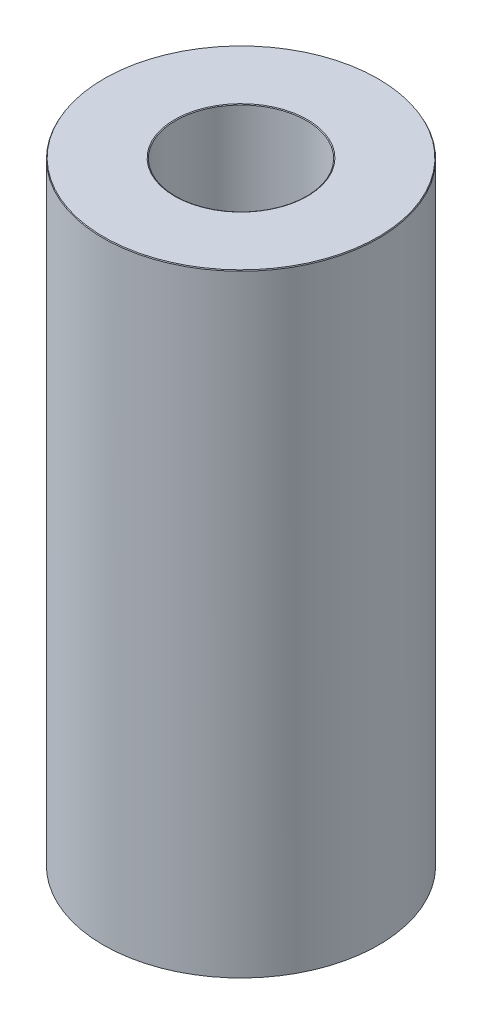
ISO-10303-21;
HEADER;
FILE_DESCRIPTION(('STEP AP214'),'2;1');
FILE_NAME('part.step','',(''),(''),'','','');
FILE_SCHEMA(('AUTOMOTIVE_DESIGN { 1 0 10303 214 1 1 1 1 }'));
ENDSEC;
DATA;
#1=APPLICATION_CONTEXT('core data for automotive mechanical design processes');
#2=APPLICATION_PROTOCOL_DEFINITION('international standard','automotive_design',2000,#1);
#3=PRODUCT_CONTEXT('',#1,'mechanical');
#4=PRODUCT('Part','Part','',(#3));
#5=PRODUCT_RELATED_PRODUCT_CATEGORY('part','',(#4));
#6=PRODUCT_DEFINITION_FORMATION('','',#4);
#7=PRODUCT_DEFINITION_CONTEXT('part definition',#1,'design');
#8=PRODUCT_DEFINITION('design','',#6,#7);
#9=PRODUCT_DEFINITION_SHAPE('','',#8);
#10=(LENGTH_UNIT() NAMED_UNIT(*) SI_UNIT(.MILLI.,.METRE.));
#11=(NAMED_UNIT(*) PLANE_ANGLE_UNIT() SI_UNIT($,.RADIAN.));
#12=(NAMED_UNIT(*) SI_UNIT($,.STERADIAN.) SOLID_ANGLE_UNIT());
#13=UNCERTAINTY_MEASURE_WITH_UNIT(LENGTH_MEASURE(1.E-05),#10,'distance_accuracy_value','');
#14=(GEOMETRIC_REPRESENTATION_CONTEXT(3) GLOBAL_UNCERTAINTY_ASSIGNED_CONTEXT((#13)) GLOBAL_UNIT_ASSIGNED_CONTEXT((#10,
#11,#12)) REPRESENTATION_CONTEXT('',''));
#15=CARTESIAN_POINT('',(0.,0.,0.));
#16=DIRECTION('',(0.,0.,1.));
#17=DIRECTION('',(1.,0.,0.));
#18=AXIS2_PLACEMENT_3D('',#15,#16,#17);
#19=CARTESIAN_POINT('',(0.,167.16921961513,0.));
#20=DIRECTION('',(0.,-1.,0.));
#21=DIRECTION('',(0.,0.,-1.));
#22=AXIS2_PLACEMENT_3D('',#19,#20,#21);
#23=CYLINDRICAL_SURFACE('',#22,37.5);
#24=CARTESIAN_POINT('',(0.,0.136813368548816,0.));
#25=DIRECTION('',(0.,1.,0.));
#26=DIRECTION('',(0.,0.,1.));
#27=AXIS2_PLACEMENT_3D('',#24,#25,#26);
#28=CIRCLE('',#27,37.5);
#29=CARTESIAN_POINT('',(0.,0.136813368548816,37.5));
#30=VERTEX_POINT('',#29);
#31=EDGE_CURVE('E10',#30,#30,#28,.T.);
#32=ORIENTED_EDGE('',*,*,#31,.T.);
#33=EDGE_LOOP('',(#32));
#34=FACE_BOUND('',#33,.T.);
#35=CARTESIAN_POINT('',(0.,166.932251909649,0.));
#36=DIRECTION('',(0.,1.,0.));
#37=DIRECTION('',(0.,0.,1.));
#38=AXIS2_PLACEMENT_3D('',#35,#36,#37);
#39=CIRCLE('',#38,37.5);
#40=CARTESIAN_POINT('',(0.,166.932251909649,-37.5));
#41=VERTEX_POINT('',#40);
#42=EDGE_CURVE('E50',#41,#41,#39,.F.);
#43=ORIENTED_EDGE('',*,*,#42,.T.);
#44=EDGE_LOOP('',(#43));
#45=FACE_BOUND('',#44,.T.);
#46=ADVANCED_FACE('F39',(#34,#45),#23,.T.);
#47=CARTESIAN_POINT('',(0.,167.16921961513,0.));
#48=DIRECTION('',(0.,1.,0.));
#49=DIRECTION('',(0.,0.,1.));
#50=AXIS2_PLACEMENT_3D('',#47,#48,#49);
#51=PLANE('',#50);
#52=CARTESIAN_POINT('',(0.,167.16921961513,0.));
#53=DIRECTION('',(0.,1.,0.));
#54=DIRECTION('',(0.,0.,1.));
#55=AXIS2_PLACEMENT_3D('',#52,#53,#54);
#56=CIRCLE('',#55,18.0977422977197);
#57=CARTESIAN_POINT('',(0.,167.16921961513,18.0977422977197));
#58=VERTEX_POINT('',#57);
#59=EDGE_CURVE('E58',#58,#58,#56,.F.);
#60=ORIENTED_EDGE('',*,*,#59,.T.);
#61=EDGE_LOOP('',(#60));
#62=FACE_BOUND('',#61,.T.);
#63=CARTESIAN_POINT('',(0.,167.16921961513,0.));
#64=DIRECTION('',(0.,1.,0.));
#65=DIRECTION('',(0.,0.,1.));
#66=AXIS2_PLACEMENT_3D('',#63,#64,#65);
#67=CIRCLE('',#66,37.3631866314512);
#68=CARTESIAN_POINT('',(0.,167.16921961513,-37.3631866314512));
#69=VERTEX_POINT('',#68);
#70=EDGE_CURVE('E61',#69,#69,#67,.T.);
#71=ORIENTED_EDGE('',*,*,#70,.T.);
#72=EDGE_LOOP('',(#71));
#73=FACE_BOUND('',#72,.T.);
#74=ADVANCED_FACE('F88',(#62,#73),#51,.T.);
#75=CARTESIAN_POINT('',(0.,0.,0.));
#76=DIRECTION('',(0.,1.,0.));
#77=DIRECTION('',(0.,0.,1.));
#78=AXIS2_PLACEMENT_3D('',#75,#76,#77);
#79=PLANE('',#78);
#80=CARTESIAN_POINT('',(0.,0.,0.));
#81=DIRECTION('',(0.,1.,0.));
#82=DIRECTION('',(0.,0.,1.));
#83=AXIS2_PLACEMENT_3D('',#80,#81,#82);
#84=CIRCLE('',#83,17.9975879607872);
#85=CARTESIAN_POINT('',(0.,0.,17.9975879607872));
#86=VERTEX_POINT('',#85);
#87=EDGE_CURVE('E51',#86,#86,#84,.T.);
#88=ORIENTED_EDGE('',*,*,#87,.T.);
#89=EDGE_LOOP('',(#88));
#90=FACE_BOUND('',#89,.T.);
#91=CARTESIAN_POINT('',(0.,0.,0.));
#92=DIRECTION('',(0.,1.,0.));
#93=DIRECTION('',(0.,0.,1.));
#94=AXIS2_PLACEMENT_3D('',#91,#92,#93);
#95=CIRCLE('',#94,37.2630322945188);
#96=CARTESIAN_POINT('',(0.,0.,37.2630322945188));
#97=VERTEX_POINT('',#96);
#98=EDGE_CURVE('E54',#97,#97,#95,.F.);
#99=ORIENTED_EDGE('',*,*,#98,.T.);
#100=EDGE_LOOP('',(#99));
#101=FACE_BOUND('',#100,.T.);
#102=ADVANCED_FACE('F83',(#90,#101),#79,.F.);
#103=CARTESIAN_POINT('',(0.,167.16921961513,0.));
#104=DIRECTION('',(0.,-1.,0.));
#105=DIRECTION('',(0.,0.,-1.));
#106=AXIS2_PLACEMENT_3D('',#103,#104,#105);
#107=CYLINDRICAL_SURFACE('',#106,17.8607745922384);
#108=CARTESIAN_POINT('',(0.,167.032406246581,0.));
#109=DIRECTION('',(0.,1.,0.));
#110=DIRECTION('',(0.,0.,1.));
#111=AXIS2_PLACEMENT_3D('',#108,#109,#110);
#112=CIRCLE('',#111,17.8607745922384);
#113=CARTESIAN_POINT('',(0.,167.032406246581,17.8607745922384));
#114=VERTEX_POINT('',#113);
#115=EDGE_CURVE('E67',#114,#114,#112,.T.);
#116=ORIENTED_EDGE('',*,*,#115,.T.);
#117=EDGE_LOOP('',(#116));
#118=FACE_BOUND('',#117,.T.);
#119=CARTESIAN_POINT('',(0.,0.236967705481206,0.));
#120=DIRECTION('',(0.,1.,0.));
#121=DIRECTION('',(0.,0.,1.));
#122=AXIS2_PLACEMENT_3D('',#119,#120,#121);
#123=CIRCLE('',#122,17.8607745922384);
#124=CARTESIAN_POINT('',(0.,0.236967705481206,17.8607745922384));
#125=VERTEX_POINT('',#124);
#126=EDGE_CURVE('E69',#125,#125,#123,.F.);
#127=ORIENTED_EDGE('',*,*,#126,.T.);
#128=EDGE_LOOP('',(#127));
#129=FACE_BOUND('',#128,.T.);
#130=ADVANCED_FACE('F71',(#118,#129),#107,.F.);
#131=CARTESIAN_POINT('',(0.,167.032406246581,0.));
#132=DIRECTION('',(0.,1.,0.));
#133=DIRECTION('',(0.,0.,1.));
#134=AXIS2_PLACEMENT_3D('',#131,#132,#133);
#135=CONICAL_SURFACE('',#134,17.8607745922384,1.04719755119657);
#136=ORIENTED_EDGE('',*,*,#59,.F.);
#137=EDGE_LOOP('',(#136));
#138=FACE_BOUND('',#137,.T.);
#139=ORIENTED_EDGE('',*,*,#115,.F.);
#140=EDGE_LOOP('',(#139));
#141=FACE_BOUND('',#140,.T.);
#142=ADVANCED_FACE('F77',(#138,#141),#135,.F.);
#143=CARTESIAN_POINT('',(0.,0.,0.));
#144=DIRECTION('',(0.,-1.,0.));
#145=DIRECTION('',(0.,0.,-1.));
#146=AXIS2_PLACEMENT_3D('',#143,#144,#145);
#147=CONICAL_SURFACE('',#146,17.9975879607872,0.523598775598312);
#148=ORIENTED_EDGE('',*,*,#126,.F.);
#149=EDGE_LOOP('',(#148));
#150=FACE_BOUND('',#149,.T.);
#151=ORIENTED_EDGE('',*,*,#87,.F.);
#152=EDGE_LOOP('',(#151));
#153=FACE_BOUND('',#152,.T.);
#154=ADVANCED_FACE('F73',(#150,#153),#147,.F.);
#155=CARTESIAN_POINT('',(0.,0.136813368548816,0.));
#156=DIRECTION('',(0.,1.,0.));
#157=DIRECTION('',(0.,0.,1.));
#158=AXIS2_PLACEMENT_3D('',#155,#156,#157);
#159=CONICAL_SURFACE('',#158,37.5,1.04719755119662);
#160=ORIENTED_EDGE('',*,*,#98,.F.);
#161=EDGE_LOOP('',(#160));
#162=FACE_BOUND('',#161,.T.);
#163=ORIENTED_EDGE('',*,*,#31,.F.);
#164=EDGE_LOOP('',(#163));
#165=FACE_BOUND('',#164,.T.);
#166=ADVANCED_FACE('F76',(#162,#165),#159,.T.);
#167=CARTESIAN_POINT('',(0.,167.16921961513,0.));
#168=DIRECTION('',(0.,-1.,0.));
#169=DIRECTION('',(0.,0.,-1.));
#170=AXIS2_PLACEMENT_3D('',#167,#168,#169);
#171=CONICAL_SURFACE('',#170,37.3631866314512,0.523598775598316);
#172=CARTESIAN_POINT('',(0.,166.932251909649,-37.5));
#173=CARTESIAN_POINT('',(0.,166.934720323248,-37.4985748607443));
#174=CARTESIAN_POINT('',(0.,166.937188736846,-37.4971497214886));
#175=CARTESIAN_POINT('',(0.,166.942125564044,-37.4942994429771));
#176=CARTESIAN_POINT('',(0.,166.944593977643,-37.4928743037214));
#177=CARTESIAN_POINT('',(0.,166.94953080484,-37.49002402521));
#178=CARTESIAN_POINT('',(0.,166.951999218439,-37.4885988859543));
#179=CARTESIAN_POINT('',(0.,166.956936045637,-37.4857486074428));
#180=CARTESIAN_POINT('',(0.,166.959404459235,-37.4843234681871));
#181=CARTESIAN_POINT('',(0.,166.964341286433,-37.4814731896757));
#182=CARTESIAN_POINT('',(0.,166.966809700032,-37.48004805042));
#183=CARTESIAN_POINT('',(0.,166.971746527229,-37.4771977719085));
#184=CARTESIAN_POINT('',(0.,166.974214940828,-37.4757726326528));
#185=CARTESIAN_POINT('',(0.,166.979151768025,-37.4729223541414));
#186=CARTESIAN_POINT('',(0.,166.981620181624,-37.4714972148857));
#187=CARTESIAN_POINT('',(0.,166.986557008822,-37.4686469363742));
#188=CARTESIAN_POINT('',(0.,166.98902542242,-37.4672217971185));
#189=CARTESIAN_POINT('',(0.,166.993962249618,-37.4643715186071));
#190=CARTESIAN_POINT('',(0.,166.996430663217,-37.4629463793514));
#191=CARTESIAN_POINT('',(0.,167.001367490414,-37.4600961008399));
#192=CARTESIAN_POINT('',(0.,167.003835904013,-37.4586709615842));
#193=CARTESIAN_POINT('',(0.,167.008772731211,-37.4558206830728));
#194=CARTESIAN_POINT('',(0.,167.011241144809,-37.4543955438171));
#195=CARTESIAN_POINT('',(0.,167.016177972007,-37.4515452653056));
#196=CARTESIAN_POINT('',(0.,167.018646385606,-37.4501201260499));
#197=CARTESIAN_POINT('',(0.,167.023583212803,-37.4472698475385));
#198=CARTESIAN_POINT('',(0.,167.026051626402,-37.4458447082828));
#199=CARTESIAN_POINT('',(0.,167.030988453599,-37.4429944297713));
#200=CARTESIAN_POINT('',(0.,167.033456867198,-37.4415692905156));
#201=CARTESIAN_POINT('',(0.,167.038393694396,-37.4387190120042));
#202=CARTESIAN_POINT('',(0.,167.040862107994,-37.4372938727485));
#203=CARTESIAN_POINT('',(0.,167.045798935192,-37.434443594237));
#204=CARTESIAN_POINT('',(0.,167.048267348791,-37.4330184549813));
#205=CARTESIAN_POINT('',(0.,167.053204175988,-37.4301681764699));
#206=CARTESIAN_POINT('',(0.,167.055672589587,-37.4287430372142));
#207=CARTESIAN_POINT('',(0.,167.060609416785,-37.4258927587027));
#208=CARTESIAN_POINT('',(0.,167.063077830383,-37.424467619447));
#209=CARTESIAN_POINT('',(0.,167.068014657581,-37.4216173409356));
#210=CARTESIAN_POINT('',(0.,167.07048307118,-37.4201922016799));
#211=CARTESIAN_POINT('',(0.,167.075419898377,-37.4173419231684));
#212=CARTESIAN_POINT('',(0.,167.077888311976,-37.4159167839127));
#213=CARTESIAN_POINT('',(0.,167.082825139173,-37.4130665054013));
#214=CARTESIAN_POINT('',(0.,167.085293552772,-37.4116413661456));
#215=CARTESIAN_POINT('',(0.,167.09023037997,-37.4087910876341));
#216=CARTESIAN_POINT('',(0.,167.092698793568,-37.4073659483784));
#217=CARTESIAN_POINT('',(0.,167.097635620766,-37.404515669867));
#218=CARTESIAN_POINT('',(0.,167.100104034365,-37.4030905306113));
#219=CARTESIAN_POINT('',(0.,167.105040861562,-37.4002402520998));
#220=CARTESIAN_POINT('',(0.,167.107509275161,-37.3988151128441));
#221=CARTESIAN_POINT('',(0.,167.112446102359,-37.3959648343327));
#222=CARTESIAN_POINT('',(0.,167.114914515957,-37.3945396950769));
#223=CARTESIAN_POINT('',(0.,167.119851343155,-37.3916894165655));
#224=CARTESIAN_POINT('',(0.,167.122319756754,-37.3902642773098));
#225=CARTESIAN_POINT('',(0.,167.127256583951,-37.3874139987984));
#226=CARTESIAN_POINT('',(0.,167.12972499755,-37.3859888595426));
#227=CARTESIAN_POINT('',(0.,167.134661824747,-37.3831385810312));
#228=CARTESIAN_POINT('',(0.,167.137130238346,-37.3817134417755));
#229=CARTESIAN_POINT('',(0.,167.142067065544,-37.3788631632641));
#230=CARTESIAN_POINT('',(0.,167.144535479142,-37.3774380240083));
#231=CARTESIAN_POINT('',(0.,167.14947230634,-37.3745877454969));
#232=CARTESIAN_POINT('',(0.,167.151940719939,-37.3731626062412));
#233=CARTESIAN_POINT('',(0.,167.156877547136,-37.3703123277298));
#234=CARTESIAN_POINT('',(0.,167.159345960735,-37.368887188474));
#235=CARTESIAN_POINT('',(0.,167.164282787933,-37.3660369099626));
#236=CARTESIAN_POINT('',(0.,167.166751201531,-37.3646117707069));
#237=CARTESIAN_POINT('',(0.,167.16921961513,-37.3631866314512));
#238=B_SPLINE_CURVE_WITH_KNOTS('',3,(#172,#173,#174,#175,#176,#177,#178,#179,#180,#181,#182,
#183,#184,#185,#186,#187,#188,#189,#190,#191,#192,#193,#194,#195,#196,#197,#198,#199,#200,#201,
#202,#203,#204,#205,#206,#207,#208,#209,#210,#211,#212,#213,#214,#215,#216,#217,#218,#219,#220,
#221,#222,#223,#224,#225,#226,#227,#228,#229,#230,#231,#232,#233,#234,#235,#236,#237),
.UNSPECIFIED.,.F.,.F.,(4,2,2,2,2,2,2,2,2,2,2,2,2,2,2,2,2,2,2,2,2,2,2,2,2,2,2,2,2,2,2,2,4),(0.,
0.00855083553432619,0.0171016710686283,0.025652506602927,0.0342033421372292,0.0427541776715313,
0.0513050132058335,0.0598558487401356,0.0684066842744378,0.0769575198087399,0.0855083553430421,
0.0940591908773408,0.102610026411643,0.111160861945945,0.119711697480247,0.128262533014549,
0.136813368548852,0.145364204083154,0.153915039617456,0.162465875151755,0.171016710686057,
0.179567546220359,0.188118381754661,0.196669217288963,0.205220052823265,0.213770888357568,
0.22232172389187,0.230872559426168,0.239423394960471,0.247974230494773,0.256525066029075,
0.265075901563377,0.273626737097703),.UNSPECIFIED.);
#239=EDGE_CURVE('BSEAM45',#41,#69,#238,.T.);
#240=ORIENTED_EDGE('',*,*,#42,.F.);
#241=ORIENTED_EDGE('',*,*,#70,.F.);
#242=ORIENTED_EDGE('',*,*,#239,.T.);
#243=ORIENTED_EDGE('',*,*,#239,.F.);
#244=EDGE_LOOP('',(#240,#242,#241,#243));
#245=FACE_BOUND('',#244,.T.);
#246=ADVANCED_FACE('F45',(#245),#171,.T.);
#247=CLOSED_SHELL('',(#46,#74,#102,#130,#142,#154,#166,#246));
#248=MANIFOLD_SOLID_BREP('B2',#247);
#249=ADVANCED_BREP_SHAPE_REPRESENTATION('',(#18,#248),#14);
#250=SHAPE_DEFINITION_REPRESENTATION(#9,#249);
ENDSEC;
END-ISO-10303-21;
